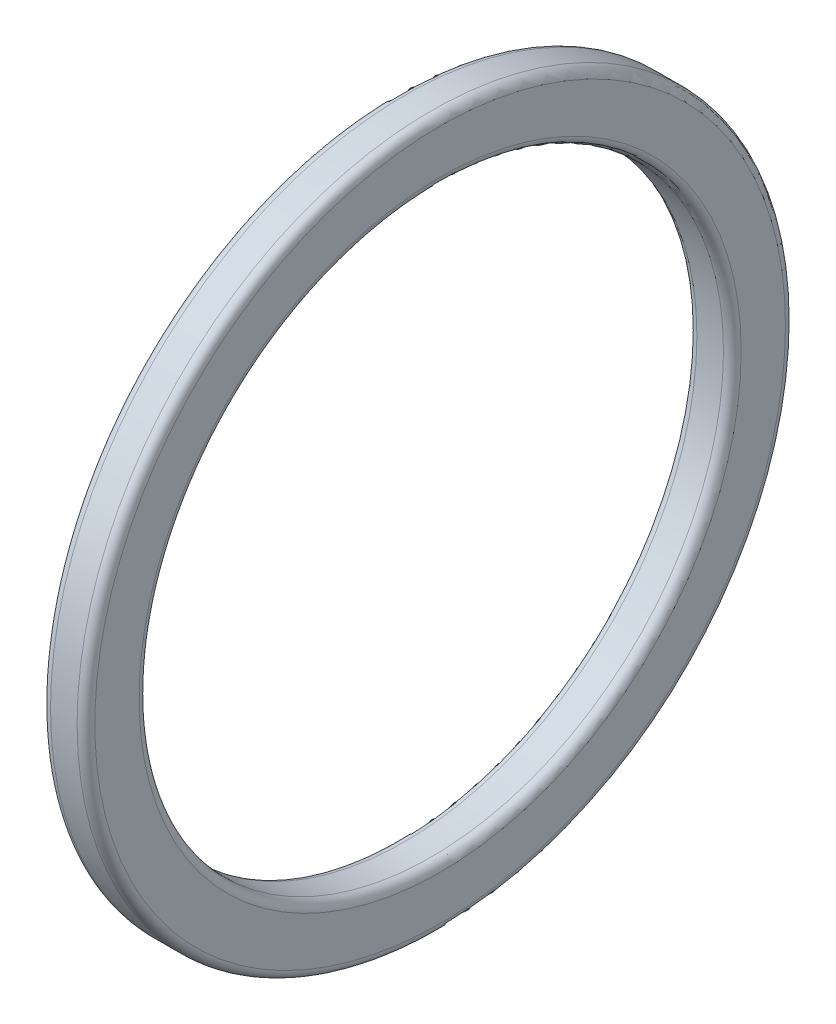
ISO-10303-21;
HEADER;
FILE_DESCRIPTION(('STEP AP214'),'2;1');
FILE_NAME('part.step','',(''),(''),'','','');
FILE_SCHEMA(('AUTOMOTIVE_DESIGN { 1 0 10303 214 1 1 1 1 }'));
ENDSEC;
DATA;
#1=APPLICATION_CONTEXT('core data for automotive mechanical design processes');
#2=APPLICATION_PROTOCOL_DEFINITION('international standard','automotive_design',2000,#1);
#3=PRODUCT_CONTEXT('',#1,'mechanical');
#4=PRODUCT('Part','Part','',(#3));
#5=PRODUCT_RELATED_PRODUCT_CATEGORY('part','',(#4));
#6=PRODUCT_DEFINITION_FORMATION('','',#4);
#7=PRODUCT_DEFINITION_CONTEXT('part definition',#1,'design');
#8=PRODUCT_DEFINITION('design','',#6,#7);
#9=PRODUCT_DEFINITION_SHAPE('','',#8);
#10=(LENGTH_UNIT() NAMED_UNIT(*) SI_UNIT(.MILLI.,.METRE.));
#11=(NAMED_UNIT(*) PLANE_ANGLE_UNIT() SI_UNIT($,.RADIAN.));
#12=(NAMED_UNIT(*) SI_UNIT($,.STERADIAN.) SOLID_ANGLE_UNIT());
#13=UNCERTAINTY_MEASURE_WITH_UNIT(LENGTH_MEASURE(1.E-05),#10,'distance_accuracy_value','');
#14=(GEOMETRIC_REPRESENTATION_CONTEXT(3) GLOBAL_UNCERTAINTY_ASSIGNED_CONTEXT((#13)) GLOBAL_UNIT_ASSIGNED_CONTEXT((#10,
#11,#12)) REPRESENTATION_CONTEXT('',''));
#15=CARTESIAN_POINT('',(0.,0.,0.));
#16=DIRECTION('',(0.,0.,1.));
#17=DIRECTION('',(1.,0.,0.));
#18=AXIS2_PLACEMENT_3D('',#15,#16,#17);
#19=CARTESIAN_POINT('',(0.999999999999218,0.,0.));
#20=DIRECTION('',(1.,0.,0.));
#21=DIRECTION('',(0.,0.,-1.));
#22=AXIS2_PLACEMENT_3D('',#19,#20,#21);
#23=TOROIDAL_SURFACE('',#22,39.0000000000008,0.999999999999217);
#24=CARTESIAN_POINT('',(0.,0.,0.));
#25=DIRECTION('',(1.,0.,0.));
#26=DIRECTION('',(0.,0.,-1.));
#27=AXIS2_PLACEMENT_3D('',#24,#25,#26);
#28=CIRCLE('',#27,39.0000000000008);
#29=CARTESIAN_POINT('',(0.,0.,-39.0000000000008));
#30=VERTEX_POINT('',#29);
#31=EDGE_CURVE('E43',#30,#30,#28,.T.);
#32=ORIENTED_EDGE('',*,*,#31,.T.);
#33=EDGE_LOOP('',(#32));
#34=FACE_BOUND('',#33,.T.);
#35=CARTESIAN_POINT('',(1.,0.,0.));
#36=DIRECTION('',(1.,0.,0.));
#37=DIRECTION('',(0.,0.,-1.));
#38=AXIS2_PLACEMENT_3D('',#35,#36,#37);
#39=CIRCLE('',#38,40.);
#40=CARTESIAN_POINT('',(1.,0.,-40.));
#41=VERTEX_POINT('',#40);
#42=EDGE_CURVE('E40',#41,#41,#39,.T.);
#43=ORIENTED_EDGE('',*,*,#42,.F.);
#44=EDGE_LOOP('',(#43));
#45=FACE_BOUND('',#44,.T.);
#46=ADVANCED_FACE('F14',(#34,#45),#23,.T.);
#47=CARTESIAN_POINT('',(0.,39.,0.));
#48=DIRECTION('',(-1.,0.,0.));
#49=DIRECTION('',(0.,0.,1.));
#50=AXIS2_PLACEMENT_3D('',#47,#48,#49);
#51=PLANE('',#50);
#52=CARTESIAN_POINT('',(0.,0.,0.));
#53=DIRECTION('',(1.,0.,0.));
#54=DIRECTION('',(0.,0.,-1.));
#55=AXIS2_PLACEMENT_3D('',#52,#53,#54);
#56=CIRCLE('',#55,33.9999999999992);
#57=CARTESIAN_POINT('',(0.,0.,-33.9999999999992));
#58=VERTEX_POINT('',#57);
#59=EDGE_CURVE('E37',#58,#58,#56,.T.);
#60=ORIENTED_EDGE('',*,*,#59,.T.);
#61=EDGE_LOOP('',(#60));
#62=FACE_BOUND('',#61,.T.);
#63=ORIENTED_EDGE('',*,*,#31,.F.);
#64=EDGE_LOOP('',(#63));
#65=FACE_BOUND('',#64,.T.);
#66=ADVANCED_FACE('F49',(#62,#65),#51,.T.);
#67=CARTESIAN_POINT('',(5.,0.,0.));
#68=DIRECTION('',(1.,0.,0.));
#69=DIRECTION('',(0.,0.,-1.));
#70=AXIS2_PLACEMENT_3D('',#67,#68,#69);
#71=CYLINDRICAL_SURFACE('',#70,40.);
#72=ORIENTED_EDGE('',*,*,#42,.T.);
#73=EDGE_LOOP('',(#72));
#74=FACE_BOUND('',#73,.T.);
#75=CARTESIAN_POINT('',(4.,0.,0.));
#76=DIRECTION('',(1.,0.,0.));
#77=DIRECTION('',(0.,0.,-1.));
#78=AXIS2_PLACEMENT_3D('',#75,#76,#77);
#79=CIRCLE('',#78,40.);
#80=CARTESIAN_POINT('',(4.,0.,-40.));
#81=VERTEX_POINT('',#80);
#82=EDGE_CURVE('E34',#81,#81,#79,.T.);
#83=ORIENTED_EDGE('',*,*,#82,.F.);
#84=EDGE_LOOP('',(#83));
#85=FACE_BOUND('',#84,.T.);
#86=ADVANCED_FACE('F51',(#74,#85),#71,.T.);
#87=CARTESIAN_POINT('',(0.999999999999218,0.,0.));
#88=DIRECTION('',(1.,0.,0.));
#89=DIRECTION('',(0.,0.,-1.));
#90=AXIS2_PLACEMENT_3D('',#87,#88,#89);
#91=TOROIDAL_SURFACE('',#90,33.9999999999992,0.999999999999218);
#92=CARTESIAN_POINT('',(1.,0.,0.));
#93=DIRECTION('',(1.,0.,0.));
#94=DIRECTION('',(0.,0.,-1.));
#95=AXIS2_PLACEMENT_3D('',#92,#93,#94);
#96=CIRCLE('',#95,33.);
#97=CARTESIAN_POINT('',(1.,0.,-33.));
#98=VERTEX_POINT('',#97);
#99=EDGE_CURVE('E29',#98,#98,#96,.T.);
#100=ORIENTED_EDGE('',*,*,#99,.T.);
#101=EDGE_LOOP('',(#100));
#102=FACE_BOUND('',#101,.T.);
#103=ORIENTED_EDGE('',*,*,#59,.F.);
#104=EDGE_LOOP('',(#103));
#105=FACE_BOUND('',#104,.T.);
#106=ADVANCED_FACE('F59',(#102,#105),#91,.T.);
#107=CARTESIAN_POINT('',(4.0000000000007,0.,0.));
#108=DIRECTION('',(1.,0.,0.));
#109=DIRECTION('',(0.,0.,-1.));
#110=AXIS2_PLACEMENT_3D('',#107,#108,#109);
#111=TOROIDAL_SURFACE('',#110,39.0000000000007,0.999999999999302);
#112=ORIENTED_EDGE('',*,*,#82,.T.);
#113=EDGE_LOOP('',(#112));
#114=FACE_BOUND('',#113,.T.);
#115=CARTESIAN_POINT('',(5.,0.,0.));
#116=DIRECTION('',(1.,0.,0.));
#117=DIRECTION('',(0.,0.,-1.));
#118=AXIS2_PLACEMENT_3D('',#115,#116,#117);
#119=CIRCLE('',#118,38.9999999385616);
#120=CARTESIAN_POINT('',(5.,0.,-38.9999999385616));
#121=VERTEX_POINT('',#120);
#122=EDGE_CURVE('E25',#121,#121,#119,.T.);
#123=ORIENTED_EDGE('',*,*,#122,.F.);
#124=EDGE_LOOP('',(#123));
#125=FACE_BOUND('',#124,.T.);
#126=ADVANCED_FACE('F66',(#114,#125),#111,.T.);
#127=CARTESIAN_POINT('',(5.,0.,0.));
#128=DIRECTION('',(1.,0.,0.));
#129=DIRECTION('',(0.,0.,-1.));
#130=AXIS2_PLACEMENT_3D('',#127,#128,#129);
#131=CYLINDRICAL_SURFACE('',#130,33.);
#132=CARTESIAN_POINT('',(4.,0.,0.));
#133=DIRECTION('',(1.,0.,0.));
#134=DIRECTION('',(0.,0.,-1.));
#135=AXIS2_PLACEMENT_3D('',#132,#133,#134);
#136=CIRCLE('',#135,33.);
#137=CARTESIAN_POINT('',(4.,0.,-33.));
#138=VERTEX_POINT('',#137);
#139=EDGE_CURVE('E21',#138,#138,#136,.T.);
#140=ORIENTED_EDGE('',*,*,#139,.T.);
#141=EDGE_LOOP('',(#140));
#142=FACE_BOUND('',#141,.T.);
#143=ORIENTED_EDGE('',*,*,#99,.F.);
#144=EDGE_LOOP('',(#143));
#145=FACE_BOUND('',#144,.T.);
#146=ADVANCED_FACE('F70',(#142,#145),#131,.F.);
#147=CARTESIAN_POINT('',(5.,34.,0.));
#148=DIRECTION('',(1.,0.,0.));
#149=DIRECTION('',(0.,0.,-1.));
#150=AXIS2_PLACEMENT_3D('',#147,#148,#149);
#151=PLANE('',#150);
#152=ORIENTED_EDGE('',*,*,#122,.T.);
#153=EDGE_LOOP('',(#152));
#154=FACE_BOUND('',#153,.T.);
#155=CARTESIAN_POINT('',(5.,0.,0.));
#156=DIRECTION('',(1.,0.,0.));
#157=DIRECTION('',(0.,0.,-1.));
#158=AXIS2_PLACEMENT_3D('',#155,#156,#157);
#159=CIRCLE('',#158,33.9999999999993);
#160=CARTESIAN_POINT('',(5.,0.,-33.9999999999993));
#161=VERTEX_POINT('',#160);
#162=EDGE_CURVE('E9',#161,#161,#159,.T.);
#163=ORIENTED_EDGE('',*,*,#162,.F.);
#164=EDGE_LOOP('',(#163));
#165=FACE_BOUND('',#164,.T.);
#166=ADVANCED_FACE('F73',(#154,#165),#151,.T.);
#167=CARTESIAN_POINT('',(4.00000000000069,0.,0.));
#168=DIRECTION('',(1.,0.,0.));
#169=DIRECTION('',(0.,0.,-1.));
#170=AXIS2_PLACEMENT_3D('',#167,#168,#169);
#171=TOROIDAL_SURFACE('',#170,33.9999999999993,0.9999999999993);
#172=ORIENTED_EDGE('',*,*,#162,.T.);
#173=EDGE_LOOP('',(#172));
#174=FACE_BOUND('',#173,.T.);
#175=ORIENTED_EDGE('',*,*,#139,.F.);
#176=EDGE_LOOP('',(#175));
#177=FACE_BOUND('',#176,.T.);
#178=ADVANCED_FACE('F16',(#174,#177),#171,.T.);
#179=CLOSED_SHELL('',(#46,#66,#86,#106,#126,#146,#166,#178));
#180=MANIFOLD_SOLID_BREP('B1',#179);
#181=ADVANCED_BREP_SHAPE_REPRESENTATION('',(#18,#180),#14);
#182=SHAPE_DEFINITION_REPRESENTATION(#9,#181);
ENDSEC;
END-ISO-10303-21;
